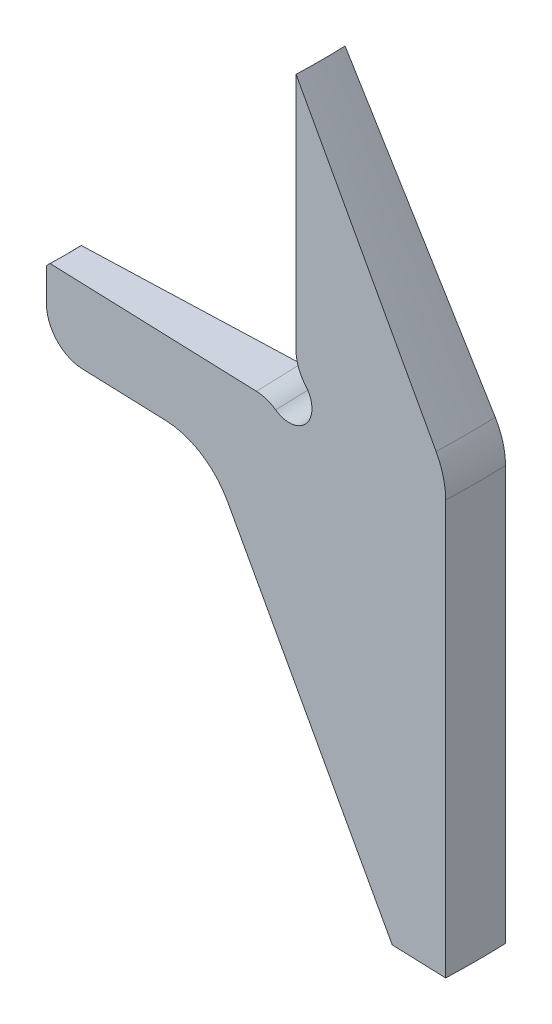
ISO-10303-21;
HEADER;
FILE_DESCRIPTION(('STEP AP214'),'2;1');
FILE_NAME('part.step','',(''),(''),'','','');
FILE_SCHEMA(('AUTOMOTIVE_DESIGN { 1 0 10303 214 1 1 1 1 }'));
ENDSEC;
DATA;
#1=APPLICATION_CONTEXT('core data for automotive mechanical design processes');
#2=APPLICATION_PROTOCOL_DEFINITION('international standard','automotive_design',2000,#1);
#3=PRODUCT_CONTEXT('',#1,'mechanical');
#4=PRODUCT('Part','Part','',(#3));
#5=PRODUCT_RELATED_PRODUCT_CATEGORY('part','',(#4));
#6=PRODUCT_DEFINITION_FORMATION('','',#4);
#7=PRODUCT_DEFINITION_CONTEXT('part definition',#1,'design');
#8=PRODUCT_DEFINITION('design','',#6,#7);
#9=PRODUCT_DEFINITION_SHAPE('','',#8);
#10=(LENGTH_UNIT() NAMED_UNIT(*) SI_UNIT(.MILLI.,.METRE.));
#11=(NAMED_UNIT(*) PLANE_ANGLE_UNIT() SI_UNIT($,.RADIAN.));
#12=(NAMED_UNIT(*) SI_UNIT($,.STERADIAN.) SOLID_ANGLE_UNIT());
#13=UNCERTAINTY_MEASURE_WITH_UNIT(LENGTH_MEASURE(1.E-05),#10,'distance_accuracy_value','');
#14=(GEOMETRIC_REPRESENTATION_CONTEXT(3) GLOBAL_UNCERTAINTY_ASSIGNED_CONTEXT((#13)) GLOBAL_UNIT_ASSIGNED_CONTEXT((#10,
#11,#12)) REPRESENTATION_CONTEXT('',''));
#15=CARTESIAN_POINT('',(0.,0.,0.));
#16=DIRECTION('',(0.,0.,1.));
#17=DIRECTION('',(1.,0.,0.));
#18=AXIS2_PLACEMENT_3D('',#15,#16,#17);
#19=CARTESIAN_POINT('',(-190.,-110.,0.));
#20=DIRECTION('',(0.,-1.,0.));
#21=DIRECTION('',(0.,0.,-1.));
#22=AXIS2_PLACEMENT_3D('',#19,#20,#21);
#23=CONICAL_SURFACE('',#22,216.961524227066,0.523598775598297);
#24=DIRECTION('',(-0.499695413509546,0.86602540378444,-0.0174497483512505));
#25=VECTOR('',#24,1.);
#26=CARTESIAN_POINT('',(-27.5092993180567,-15.8253175473054,5.67430030306673));
#27=LINE('',#26,#25);
#28=CARTESIAN_POINT('',(26.8293571286111,-110.,7.57184799933209));
#29=VERTEX_POINT('',#28);
#30=CARTESIAN_POINT('',(-19.3305279117981,-30.,5.95990929407039));
#31=VERTEX_POINT('',#30);
#32=EDGE_CURVE('E164',#29,#31,#27,.T.);
#33=ORIENTED_EDGE('',*,*,#32,.T.);
#34=CARTESIAN_POINT('',(-190.,-30.,0.));
#35=DIRECTION('',(0.,-1.,0.));
#36=DIRECTION('',(0.,0.,-1.));
#37=AXIS2_PLACEMENT_3D('',#34,#35,#36);
#38=CIRCLE('',#37,170.773502691896);
#39=CARTESIAN_POINT('',(-19.3305279117981,-30.,-5.95990929407039));
#40=VERTEX_POINT('',#39);
#41=EDGE_CURVE('E236',#31,#40,#38,.F.);
#42=ORIENTED_EDGE('',*,*,#41,.T.);
#43=DIRECTION('',(-0.499695413509546,0.86602540378444,0.0174497483512505));
#44=VECTOR('',#43,1.);
#45=CARTESIAN_POINT('',(-27.5092993180567,-15.8253175473054,-5.67430030306673));
#46=LINE('',#45,#44);
#47=CARTESIAN_POINT('',(26.8293571286111,-110.,-7.57184799933209));
#48=VERTEX_POINT('',#47);
#49=EDGE_CURVE('E167',#48,#40,#46,.T.);
#50=ORIENTED_EDGE('',*,*,#49,.F.);
#51=CARTESIAN_POINT('',(-190.,-110.,0.));
#52=DIRECTION('',(0.,-1.,0.));
#53=DIRECTION('',(0.,0.,-1.));
#54=AXIS2_PLACEMENT_3D('',#51,#52,#53);
#55=CIRCLE('',#54,216.961524227066);
#56=EDGE_CURVE('E162',#48,#29,#55,.T.);
#57=ORIENTED_EDGE('',*,*,#56,.T.);
#58=EDGE_LOOP('',(#33,#42,#50,#57));
#59=FACE_BOUND('',#58,.T.);
#60=ADVANCED_FACE('F43',(#59),#23,.F.);
#61=CARTESIAN_POINT('',(-0.115742866371919,-110.,-6.6309043734752));
#62=DIRECTION('',(0.,1.,0.));
#63=DIRECTION('',(0.,0.,1.));
#64=AXIS2_PLACEMENT_3D('',#61,#62,#63);
#65=PLANE('',#64);
#66=CARTESIAN_POINT('',(-190.,-110.,0.));
#67=DIRECTION('',(0.,-1.,0.));
#68=DIRECTION('',(0.,0.,-1.));
#69=AXIS2_PLACEMENT_3D('',#66,#67,#68);
#70=CIRCLE('',#69,231.961524227066);
#71=CARTESIAN_POINT('',(41.8202195338975,-110.,-8.09534044986961));
#72=VERTEX_POINT('',#71);
#73=CARTESIAN_POINT('',(41.8202195338975,-110.,8.09534044986961));
#74=VERTEX_POINT('',#73);
#75=EDGE_CURVE('E174',#72,#74,#70,.T.);
#76=ORIENTED_EDGE('',*,*,#75,.T.);
#77=DIRECTION('',(-0.999390827019096,0.,-0.034899496702501));
#78=VECTOR('',#77,1.);
#79=CARTESIAN_POINT('',(-0.115742866371911,-110.,6.63090437347519));
#80=LINE('',#79,#78);
#81=EDGE_CURVE('E179',#74,#29,#80,.T.);
#82=ORIENTED_EDGE('',*,*,#81,.T.);
#83=ORIENTED_EDGE('',*,*,#56,.F.);
#84=DIRECTION('',(-0.999390827019096,0.,0.0348994967025011));
#85=VECTOR('',#84,1.);
#86=CARTESIAN_POINT('',(-0.115742866371919,-110.,-6.6309043734752));
#87=LINE('',#86,#85);
#88=EDGE_CURVE('E210',#72,#48,#87,.T.);
#89=ORIENTED_EDGE('',*,*,#88,.F.);
#90=EDGE_LOOP('',(#76,#82,#83,#89));
#91=FACE_BOUND('',#90,.T.);
#92=ADVANCED_FACE('F186',(#91),#65,.F.);
#93=CARTESIAN_POINT('',(-190.,0.,0.));
#94=DIRECTION('',(0.,-1.,0.));
#95=DIRECTION('',(0.,0.,-1.));
#96=AXIS2_PLACEMENT_3D('',#93,#94,#95);
#97=CYLINDRICAL_SURFACE('',#96,231.961524227066);
#98=DIRECTION('',(0.,-1.,0.));
#99=VECTOR('',#98,1.);
#100=CARTESIAN_POINT('',(41.8202195338975,0.,-8.09534044986961));
#101=LINE('',#100,#99);
#102=CARTESIAN_POINT('',(41.8202195338975,1.9615242270665,-8.09534044986961));
#103=VERTEX_POINT('',#102);
#104=EDGE_CURVE('E212',#103,#72,#101,.T.);
#105=ORIENTED_EDGE('',*,*,#104,.F.);
#106=CARTESIAN_POINT('',(-190.,1.9615242270665,0.));
#107=DIRECTION('',(0.,1.,0.));
#108=DIRECTION('',(0.,0.,1.));
#109=AXIS2_PLACEMENT_3D('',#106,#107,#108);
#110=CIRCLE('',#109,231.961524227066);
#111=CARTESIAN_POINT('',(41.8202195338975,1.9615242270665,8.09534044986961));
#112=VERTEX_POINT('',#111);
#113=EDGE_CURVE('E239',#103,#112,#110,.F.);
#114=ORIENTED_EDGE('',*,*,#113,.T.);
#115=DIRECTION('',(0.,-1.,0.));
#116=VECTOR('',#115,1.);
#117=CARTESIAN_POINT('',(41.8202195338975,0.,8.09534044986961));
#118=LINE('',#117,#116);
#119=EDGE_CURVE('E188',#112,#74,#118,.T.);
#120=ORIENTED_EDGE('',*,*,#119,.T.);
#121=ORIENTED_EDGE('',*,*,#75,.F.);
#122=EDGE_LOOP('',(#105,#114,#120,#121));
#123=FACE_BOUND('',#122,.T.);
#124=ADVANCED_FACE('F382',(#123),#97,.T.);
#125=CARTESIAN_POINT('',(-190.,80.,0.));
#126=DIRECTION('',(0.,-1.,0.));
#127=DIRECTION('',(0.,0.,-1.));
#128=AXIS2_PLACEMENT_3D('',#125,#126,#127);
#129=CONICAL_SURFACE('',#128,190.,0.523598775598297);
#130=DIRECTION('',(0.499695413509546,-0.86602540378444,0.0174497483512505));
#131=VECTOR('',#130,1.);
#132=CARTESIAN_POINT('',(34.5041709139352,19.9999999999999,7.83985840242148));
#133=LINE('',#132,#131);
#134=CARTESIAN_POINT('',(-0.115742866371803,80.,6.6309043734752));
#135=VERTEX_POINT('',#134);
#136=CARTESIAN_POINT('',(39.1423598836692,11.9615242270665,8.00182753029273));
#137=VERTEX_POINT('',#136);
#138=EDGE_CURVE('E190',#135,#137,#133,.T.);
#139=ORIENTED_EDGE('',*,*,#138,.T.);
#140=CARTESIAN_POINT('',(-190.,11.9615242270665,0.));
#141=DIRECTION('',(0.,1.,0.));
#142=DIRECTION('',(0.,0.,1.));
#143=AXIS2_PLACEMENT_3D('',#140,#141,#142);
#144=CIRCLE('',#143,229.282032302755);
#145=CARTESIAN_POINT('',(39.1423598836692,11.9615242270665,-8.00182753029273));
#146=VERTEX_POINT('',#145);
#147=EDGE_CURVE('E244',#137,#146,#144,.T.);
#148=ORIENTED_EDGE('',*,*,#147,.T.);
#149=DIRECTION('',(0.499695413509546,-0.86602540378444,-0.0174497483512505));
#150=VECTOR('',#149,1.);
#151=CARTESIAN_POINT('',(34.5041709139352,19.9999999999999,-7.83985840242149));
#152=LINE('',#151,#150);
#153=CARTESIAN_POINT('',(-0.11574286637181,80.,-6.6309043734752));
#154=VERTEX_POINT('',#153);
#155=EDGE_CURVE('E214',#154,#146,#152,.T.);
#156=ORIENTED_EDGE('',*,*,#155,.F.);
#157=CARTESIAN_POINT('',(-190.,80.,0.));
#158=DIRECTION('',(0.,-1.,0.));
#159=DIRECTION('',(0.,0.,-1.));
#160=AXIS2_PLACEMENT_3D('',#157,#158,#159);
#161=CIRCLE('',#160,190.);
#162=EDGE_CURVE('E229',#154,#135,#161,.T.);
#163=ORIENTED_EDGE('',*,*,#162,.T.);
#164=EDGE_LOOP('',(#139,#148,#156,#163));
#165=FACE_BOUND('',#164,.T.);
#166=ADVANCED_FACE('F319',(#165),#129,.T.);
#167=CARTESIAN_POINT('',(-190.,0.,0.));
#168=DIRECTION('',(0.,-1.,0.));
#169=DIRECTION('',(0.,0.,-1.));
#170=AXIS2_PLACEMENT_3D('',#167,#168,#169);
#171=CYLINDRICAL_SURFACE('',#170,190.);
#172=DIRECTION('',(0.,1.,0.));
#173=VECTOR('',#172,1.);
#174=CARTESIAN_POINT('',(-0.115742866371817,0.,-6.6309043734752));
#175=LINE('',#174,#173);
#176=CARTESIAN_POINT('',(-0.115742866371817,14.7588839550941,-6.6309043734752));
#177=VERTEX_POINT('',#176);
#178=EDGE_CURVE('E217',#177,#154,#175,.T.);
#179=ORIENTED_EDGE('',*,*,#178,.F.);
#180=CARTESIAN_POINT('',(0.667134274224194,8.95759896307096,-33.086227751893));
#181=CARTESIAN_POINT('',(-2.74176370552451,11.9327504312319,-32.1656281770773));
#182=CARTESIAN_POINT('',(-2.65446045368407,16.5202245868414,-31.6488358727422));
#183=CARTESIAN_POINT('',(0.768508186004366,8.9047338826774,-31.9341825681366));
#184=CARTESIAN_POINT('',(-2.55182244152968,11.8754683558055,-31.0597075428148));
#185=CARTESIAN_POINT('',(-2.47009392802789,16.3871162300827,-30.5574681168625));
#186=CARTESIAN_POINT('',(0.865964263219567,8.85334792421901,-30.7802043294137));
#187=CARTESIAN_POINT('',(-2.3708638516568,11.8173309382447,-29.9470364161878));
#188=CARTESIAN_POINT('',(-2.29518917855884,16.2577321367232,-29.4640635193674));
#189=CARTESIAN_POINT('',(1.0530127110721,8.7547300066573,-28.4684270306068));
#190=CARTESIAN_POINT('',(-2.02861120265951,11.7025410499396,-27.7167586211394));
#191=CARTESIAN_POINT('',(-1.96436797033006,16.0094232554202,-27.2732223347117));
#192=CARTESIAN_POINT('',(1.14260439152294,8.70749841214394,-27.3106276444088));
#193=CARTESIAN_POINT('',(-1.86708705897681,11.6458366593084,-26.5983101221771));
#194=CARTESIAN_POINT('',(-1.8084531776815,15.8904993854735,-26.1757854024577));
#195=CARTESIAN_POINT('',(1.31394857964027,8.61835806461816,-24.990502677886));
#196=CARTESIAN_POINT('',(-1.56380075092368,11.5365835990525,-24.3560952427382));
#197=CARTESIAN_POINT('',(-1.5155887175918,15.6660539648379,-23.976209439212));
#198=CARTESIAN_POINT('',(1.39569458613769,8.5764537167538,-23.8281741603763));
#199=CARTESIAN_POINT('',(-1.42185385510603,11.483978502793,-23.2314802361726));
#200=CARTESIAN_POINT('',(-1.37865473721144,15.5605435058189,-22.874067285765));
#201=CARTESIAN_POINT('',(1.55121302986134,8.49918585962328,-21.5002545251547));
#202=CARTESIAN_POINT('',(-1.15804335513335,11.3855336526382,-20.9784182802711));
#203=CARTESIAN_POINT('',(-1.12400958891225,15.3659916881925,-20.6662767542916));
#204=CARTESIAN_POINT('',(1.62498570089126,8.46382215854281,-20.3346635041386));
#205=CARTESIAN_POINT('',(-1.03600965465167,11.3396329605667,-19.8491285600782));
#206=CARTESIAN_POINT('',(-1.00629785728391,15.2769498466181,-19.5606284800551));
#207=CARTESIAN_POINT('',(1.76426680994774,8.40082060062587,-18.0045907092262));
#208=CARTESIAN_POINT('',(-0.812562825333102,11.257031946277,-17.5911977399515));
#209=CARTESIAN_POINT('',(-0.790572085281535,15.1183189735415,-17.3499720215171));
#210=CARTESIAN_POINT('',(1.82980261238954,8.37315677012357,-16.8401187427663));
#211=CARTESIAN_POINT('',(-0.710944068877488,11.2202460392795,-16.4617389642819));
#212=CARTESIAN_POINT('',(-0.692492144197733,15.0486645432593,-16.2449745477766));
#213=CARTESIAN_POINT('',(1.95284672119456,8.32630034887294,-14.5088630105438));
#214=CARTESIAN_POINT('',(-0.527943504460698,11.1575583667022,-14.2004053186003));
#215=CARTESIAN_POINT('',(-0.51563615265279,14.9306853171667,-14.0323755942664));
#216=CARTESIAN_POINT('',(2.0103548734032,8.30710792078524,-13.3420792008232));
#217=CARTESIAN_POINT('',(-0.446454855424195,11.1316125114773,-13.0676887957924));
#218=CARTESIAN_POINT('',(-0.436860472868506,14.8823609309176,-12.9247740649064));
#219=CARTESIAN_POINT('',(2.117264391476,8.27786808171482,-11.007446958684));
#220=CARTESIAN_POINT('',(-0.303854862242663,11.0919796335105,-10.8012816006396));
#221=CARTESIAN_POINT('',(-0.298739801295778,14.8087382882925,-10.7081500205029));
#222=CARTESIAN_POINT('',(2.16666926395919,8.26781670642283,-9.83959920785168));
#223=CARTESIAN_POINT('',(-0.242657818869594,11.0782582597378,-9.6667476316496));
#224=CARTESIAN_POINT('',(-0.239386393575631,14.7834300502293,-9.59912833052618));
#225=CARTESIAN_POINT('',(2.25735519613433,8.25721037148466,-7.50319344789874));
#226=CARTESIAN_POINT('',(-0.140658917715771,11.0637888034485,-7.39727685749175));
#227=CARTESIAN_POINT('',(-0.140133141601371,14.7567244855712,-7.38000037709744));
#228=CARTESIAN_POINT('',(2.29863674432749,8.25665484062728,-6.33463548572886));
#229=CARTESIAN_POINT('',(-0.0998092608036908,11.0630291330192,-6.2614931294416));
#230=CARTESIAN_POINT('',(-0.100232127352002,14.7553257207305,-6.26989418289986));
#231=CARTESIAN_POINT('',(2.35012083027892,8.26246376172975,-4.71770129828353));
#232=CARTESIAN_POINT('',(-0.0573982866506212,11.0709539252145,-4.69042229417288));
#233=CARTESIAN_POINT('',(-0.0584953479908712,14.7699519341809,-4.7335562145751));
#234=CARTESIAN_POINT('',(2.36379952852938,8.26477505003423,-4.26925416586011));
#235=CARTESIAN_POINT('',(-0.0471346803368433,11.0741083817843,-4.25460208882068));
#236=CARTESIAN_POINT('',(-0.0483543007045109,14.7757714995944,-4.30743178481242));
#237=CARTESIAN_POINT('',(2.38995537633869,8.27078201629363,-3.37242251394286));
#238=CARTESIAN_POINT('',(-0.0296071203080356,11.0822949235631,-3.38303367218752));
#239=CARTESIAN_POINT('',(-0.0309410438588276,14.7908963684776,-3.45518208660384));
#240=CARTESIAN_POINT('',(2.40243253636975,8.27447768218139,-2.92403799393735));
#241=CARTESIAN_POINT('',(-0.0223428861444891,11.0873278872371,-2.94723752617663));
#242=CARTESIAN_POINT('',(-0.0236688092941635,14.8002016415635,-3.02905681819764));
#243=CARTESIAN_POINT('',(2.4380643492947,8.28761535694021,-1.57890415935268));
#244=CARTESIAN_POINT('',(-0.00504296787389616,11.1051920275726,-1.63967725650893));
#245=CARTESIAN_POINT('',(-0.00615274517554352,14.8332808363654,-1.75060927397026));
#246=CARTESIAN_POINT('',(2.45941501142037,8.29910754453079,-0.682310370303468));
#247=CARTESIAN_POINT('',(0.000487439010154739,11.1207896421213,-0.768039096448333));
#248=CARTESIAN_POINT('',(-0.000213059670241137,14.8622168787704,-0.898344290288824));
#249=CARTESIAN_POINT('',(2.50770020926859,8.33507459532026,1.60193791038056));
#250=CARTESIAN_POINT('',(-0.000677853179735361,11.1693352615863,1.45282438471778));
#251=CARTESIAN_POINT('',(0.000315590945780388,14.9527778882737,1.27327496392541));
#252=CARTESIAN_POINT('',(2.53126937943034,8.36321310429918,2.98906644606564));
#253=CARTESIAN_POINT('',(-0.0157921741423428,11.2071349557853,2.80174574030716));
#254=CARTESIAN_POINT('',(-0.0131130138513921,15.0236275056256,2.59229791091934));
#255=CARTESIAN_POINT('',(2.56688395259442,8.43072140174762,5.76041616248337));
#256=CARTESIAN_POINT('',(-0.074496742487387,11.2964258604122,5.49492825049505));
#257=CARTESIAN_POINT('',(-0.0673685402757303,15.1936058445098,5.22815629013314));
#258=CARTESIAN_POINT('',(2.57892851431392,8.47009200987485,7.14463712360808));
#259=CARTESIAN_POINT('',(-0.118201026339044,11.348004386642,6.84060859323841));
#260=CARTESIAN_POINT('',(-0.108197461723636,15.2927366298485,6.5449915556514));
#261=CARTESIAN_POINT('',(2.59783811426675,8.60253900922191,11.2933062489235));
#262=CARTESIAN_POINT('',(-0.292127209835841,11.518241998313,10.8783053655054));
#263=CARTESIAN_POINT('',(-0.271653014554545,15.626223353429,10.4925625392756));
#264=CARTESIAN_POINT('',(2.58744901132575,8.70992483589788,14.052334241045));
#265=CARTESIAN_POINT('',(-0.465571300246929,11.6523216909378,13.5623515718648));
#266=CARTESIAN_POINT('',(-0.435248534974838,15.8966088500329,13.1190073575536));
#267=CARTESIAN_POINT('',(2.53762222162231,8.88783439279323,18.178996887546));
#268=CARTESIAN_POINT('',(-0.806882194384979,11.8567067555848,17.5506840311638));
#269=CARTESIAN_POINT('',(-0.761893577844636,16.3445652062546,17.0490905776314));
#270=CARTESIAN_POINT('',(2.51527366759193,8.95000065562477,19.5536943794646));
#271=CARTESIAN_POINT('',(-0.935272419916723,11.9258760937013,18.8831748369782));
#272=CARTESIAN_POINT('',(-0.884451235087477,16.5010928993007,18.3585915953837));
#273=CARTESIAN_POINT('',(2.45916710720859,9.0779276803314,22.2985372625312));
#274=CARTESIAN_POINT('',(-1.21931327310273,12.0608612155418,21.5398910861035));
#275=CARTESIAN_POINT('',(-1.15660890436113,16.8231988322194,20.9738349694822));
#276=CARTESIAN_POINT('',(2.42540895247495,9.14368848894387,23.6686825942447));
#277=CARTESIAN_POINT('',(-1.37532741260926,12.1267288346485,22.8655648164975));
#278=CARTESIAN_POINT('',(-1.30620926806779,16.9887771897715,22.2795772767241));
#279=CARTESIAN_POINT('',(2.34655232286599,9.27679761280046,26.4026507350959));
#280=CARTESIAN_POINT('',(-1.71404614876678,12.2503140847362,25.5062367397936));
#281=CARTESIAN_POINT('',(-1.63219806622322,17.3239310693093,24.8856147427336));
#282=CARTESIAN_POINT('',(2.30146751762161,9.34414392641018,27.7664791616062));
#283=CARTESIAN_POINT('',(-1.89715018041173,12.3080444767054,26.8227227732966));
#284=CARTESIAN_POINT('',(-1.80855410953062,17.4935015514033,26.1859145603682));
#285=CARTESIAN_POINT('',(2.19994319968825,9.47867393047736,30.4894031023221));
#286=CARTESIAN_POINT('',(-2.28965466041325,12.4107488770535,29.4456933830482));
#287=CARTESIAN_POINT('',(-2.1881686046213,17.8322330482642,28.7825806923877));
#288=CARTESIAN_POINT('',(2.14350409682512,9.54585762671583,31.8484987855522));
#289=CARTESIAN_POINT('',(-2.49955477510499,12.4556583497594,30.7536700678683));
#290=CARTESIAN_POINT('',(-2.39142608532444,18.0013940775871,30.0789471470311));
#291=CARTESIAN_POINT('',(2.0813890476718,9.61204948654276,33.2052450635102));
#292=CARTESIAN_POINT('',(-2.72123394142446,12.4914385343895,32.0489148945612));
#293=CARTESIAN_POINT('',(-2.60813226397439,18.1680577731969,31.3733630075558));
#294=(BOUNDED_SURFACE() B_SPLINE_SURFACE(3,2,((#180,#181,#182),(#183,#184,#185),(#186,#187,
#188),(#189,#190,#191),(#192,#193,#194),(#195,#196,#197),(#198,#199,#200),(#201,#202,#203),
(#204,#205,#206),(#207,#208,#209),(#210,#211,#212),(#213,#214,#215),(#216,#217,#218),(#219,#220,
#221),(#222,#223,#224),(#225,#226,#227),(#228,#229,#230),(#231,#232,#233),(#234,#235,#236),
(#237,#238,#239),(#240,#241,#242),(#243,#244,#245),(#246,#247,#248),(#249,#250,#251),(#252,#253,
#254),(#255,#256,#257),(#258,#259,#260),(#261,#262,#263),(#264,#265,#266),(#267,#268,#269),
(#270,#271,#272),(#273,#274,#275),(#276,#277,#278),(#279,#280,#281),(#282,#283,#284),(#285,#286,
#287),(#288,#289,#290),(#291,#292,#293)),.UNSPECIFIED.,.F.,.F.,
.F.) B_SPLINE_SURFACE_WITH_KNOTS((4,2,2,2,2,2,2,2,2,2,2,2,2,2,2,2,2,2,4),(3,3),(0.,
3.51798708399858,7.03628260165581,10.5574687632261,14.0785516443337,17.5876089325519,
21.0967335957609,24.6043356883423,28.1117267845609,29.4578597379756,30.8039809578751,
33.4966309497193,37.6669125575601,41.8374985678237,50.1829515541114,54.3625431233224,
58.5421890497831,62.7168147773553,66.8912898516),(0.,1.),
.UNSPECIFIED.) GEOMETRIC_REPRESENTATION_ITEM() RATIONAL_B_SPLINE_SURFACE(((1.,0.907892624053053,
1.),(1.,0.91056277963586,1.),(1.,0.91305326888257,1.),(1.,0.917677669728983,1.),(1.,
0.91981155004719,1.),(1.,0.923726628411904,1.),(1.,0.925507535252983,1.),(1.,0.928715758702234,
1.),(1.,0.930143085680084,1.),(1.,0.932640611466148,1.),(1.,0.933712013329267,1.),(1.,
0.935504529176689,1.),(1.,0.936225636434959,1.),(1.,0.937317204954832,1.),(1.,0.937687818222124,
1.),(1.,0.938078805641152,1.),(1.,0.938099200859837,1.),(1.,0.937885139438573,1.),(1.,
0.937799978645177,1.),(1.,0.937578083745593,1.),(1.,0.937441350088948,1.),(1.,0.936953744759836,
1.),(1.,0.936525486703279,1.),(1.,0.935171052417401,1.),(1.,0.934100603053463,1.),(1.,
0.931464790521467,1.),(1.,0.929899391233743,1.),(1.,0.924457892139941,1.),(1.,0.91983733455556,
1.),(1.,0.911396793741079,1.),(1.,0.908328523489701,1.),(1.,0.90168155671136,1.),(1.,
0.898102853546621,1.),(1.,0.890431346264138,1.),(1.,0.886339164799106,1.),(1.,0.877625513013661,
1.),(1.,0.873004061799482,1.),(1.,0.868111917035176,1.))) REPRESENTATION_ITEM('') SURFACE());
#295=CARTESIAN_POINT('',(-2.65446045368407,16.5202245868414,-31.6488358727422));
#296=CARTESIAN_POINT('',(-2.47009392802789,16.3871162300827,-30.5574681168625));
#297=CARTESIAN_POINT('',(-2.29518917855884,16.2577321367232,-29.4640635193674));
#298=CARTESIAN_POINT('',(-1.96436797033006,16.0094232554202,-27.2732223347117));
#299=CARTESIAN_POINT('',(-1.8084531776815,15.8904993854735,-26.1757854024577));
#300=CARTESIAN_POINT('',(-1.5155887175918,15.6660539648379,-23.976209439212));
#301=CARTESIAN_POINT('',(-1.37865473721144,15.5605435058189,-22.874067285765));
#302=CARTESIAN_POINT('',(-1.12400958891225,15.3659916881925,-20.6662767542916));
#303=CARTESIAN_POINT('',(-1.00629785728391,15.2769498466181,-19.5606284800551));
#304=CARTESIAN_POINT('',(-0.790572085281535,15.1183189735415,-17.3499720215171));
#305=CARTESIAN_POINT('',(-0.692492144197733,15.0486645432593,-16.2449745477766));
#306=CARTESIAN_POINT('',(-0.51563615265279,14.9306853171667,-14.0323755942664));
#307=CARTESIAN_POINT('',(-0.436860472868506,14.8823609309176,-12.9247740649064));
#308=CARTESIAN_POINT('',(-0.298739801295778,14.8087382882925,-10.7081500205029));
#309=CARTESIAN_POINT('',(-0.239386393575631,14.7834300502293,-9.59912833052618));
#310=CARTESIAN_POINT('',(-0.14013314160137,14.7567244855712,-7.38000037709744));
#311=CARTESIAN_POINT('',(-0.100232127352002,14.7553257207305,-6.26989418289986));
#312=CARTESIAN_POINT('',(-0.0584953479908712,14.7699519341809,-4.7335562145751));
#313=CARTESIAN_POINT('',(-0.0483543007045109,14.7757714995944,-4.30743178481242));
#314=CARTESIAN_POINT('',(-0.0309410438588276,14.7908963684776,-3.45518208660384));
#315=CARTESIAN_POINT('',(-0.0236688092941635,14.8002016415635,-3.02905681819764));
#316=CARTESIAN_POINT('',(-0.00615274517554354,14.8332808363654,-1.75060927397026));
#317=CARTESIAN_POINT('',(-0.000213059670241142,14.8622168787704,-0.898344290288825));
#318=CARTESIAN_POINT('',(0.000315590945780396,14.9527778882737,1.27327496392541));
#319=CARTESIAN_POINT('',(-0.0131130138513921,15.0236275056256,2.59229791091935));
#320=CARTESIAN_POINT('',(-0.0673685402757303,15.1936058445098,5.22815629013314));
#321=CARTESIAN_POINT('',(-0.108197461723636,15.2927366298485,6.5449915556514));
#322=CARTESIAN_POINT('',(-0.271653014554545,15.626223353429,10.4925625392756));
#323=CARTESIAN_POINT('',(-0.435248534974838,15.8966088500329,13.1190073575536));
#324=CARTESIAN_POINT('',(-0.761893577844636,16.3445652062546,17.0490905776314));
#325=CARTESIAN_POINT('',(-0.884451235087477,16.5010928993007,18.3585915953837));
#326=CARTESIAN_POINT('',(-1.15660890436113,16.8231988322194,20.9738349694822));
#327=CARTESIAN_POINT('',(-1.30620926806779,16.9887771897715,22.2795772767241));
#328=CARTESIAN_POINT('',(-1.63219806622322,17.3239310693093,24.8856147427336));
#329=CARTESIAN_POINT('',(-1.80855410953062,17.4935015514033,26.1859145603682));
#330=CARTESIAN_POINT('',(-2.1881686046213,17.8322330482642,28.7825806923877));
#331=CARTESIAN_POINT('',(-2.39142608532444,18.0013940775871,30.0789471470311));
#332=CARTESIAN_POINT('',(-2.60813226397439,18.1680577731969,31.3733630075558));
#333=B_SPLINE_CURVE_WITH_KNOTS('',3,(#295,#296,#297,#298,#299,#300,#301,#302,#303,#304,#305,
#306,#307,#308,#309,#310,#311,#312,#313,#314,#315,#316,#317,#318,#319,#320,#321,#322,#323,#324,
#325,#326,#327,#328,#329,#330,#331,#332),.UNSPECIFIED.,.F.,.F.,(4,2,2,2,2,2,2,2,2,2,2,2,2,2,2,2,
2,2,4),(0.,3.51798708399858,7.03628260165581,10.5574687632261,14.0785516443337,17.5876089325519,
21.0967335957609,24.6043356883423,28.1117267845609,29.4578597379756,30.8039809578751,
33.4966309497193,37.6669125575601,41.8374985678237,50.1829515541114,54.3625431233224,
58.5421890497831,62.7168147773553,66.8912898516),.UNSPECIFIED.);
#334=CARTESIAN_POINT('',(-0.11574286637181,15.3035860230109,6.6309043734752));
#335=VERTEX_POINT('',#334);
#336=EDGE_CURVE('E11',#177,#335,#333,.T.);
#337=ORIENTED_EDGE('',*,*,#336,.T.);
#338=DIRECTION('',(0.,1.,0.));
#339=VECTOR('',#338,1.);
#340=CARTESIAN_POINT('',(-0.11574286637181,0.,6.6309043734752));
#341=LINE('',#340,#339);
#342=EDGE_CURVE('E196',#335,#135,#341,.T.);
#343=ORIENTED_EDGE('',*,*,#342,.T.);
#344=ORIENTED_EDGE('',*,*,#162,.F.);
#345=EDGE_LOOP('',(#179,#337,#343,#344));
#346=FACE_BOUND('',#345,.T.);
#347=ADVANCED_FACE('F313',(#346),#171,.F.);
#348=CARTESIAN_POINT('',(-0.115742866371817,0.,-6.6309043734752));
#349=DIRECTION('',(0.,-1.,0.));
#350=DIRECTION('',(0.,0.,-1.));
#351=AXIS2_PLACEMENT_3D('',#348,#349,#350);
#352=PLANE('',#351);
#353=DIRECTION('',(0.999390827019096,0.,0.034899496702501));
#354=VECTOR('',#353,1.);
#355=CARTESIAN_POINT('',(-0.11574286637181,0.,6.6309043734752));
#356=LINE('',#355,#354);
#357=CARTESIAN_POINT('',(-69.0737099306894,0.,4.22283910100263));
#358=VERTEX_POINT('',#357);
#359=CARTESIAN_POINT('',(-11.2141846253441,0.,6.24333824709254));
#360=VERTEX_POINT('',#359);
#361=EDGE_CURVE('E198',#358,#360,#356,.T.);
#362=ORIENTED_EDGE('',*,*,#361,.T.);
#363=DIRECTION('',(-0.0348994967025011,0.,-0.999390827019096));
#364=VECTOR('',#363,1.);
#365=CARTESIAN_POINT('',(-11.6496978858531,0.,-6.22812978891171));
#366=LINE('',#365,#364);
#367=CARTESIAN_POINT('',(-11.6496978858531,0.,-6.22812978891171));
#368=VERTEX_POINT('',#367);
#369=EDGE_CURVE('E276',#360,#368,#366,.T.);
#370=ORIENTED_EDGE('',*,*,#369,.T.);
#371=DIRECTION('',(0.999390827019096,0.,-0.0348994967025011));
#372=VECTOR('',#371,1.);
#373=CARTESIAN_POINT('',(-0.115742866371817,0.,-6.6309043734752));
#374=LINE('',#373,#372);
#375=CARTESIAN_POINT('',(-69.0737099306894,0.,-4.22283910100263));
#376=VERTEX_POINT('',#375);
#377=EDGE_CURVE('E219',#376,#368,#374,.T.);
#378=ORIENTED_EDGE('',*,*,#377,.F.);
#379=CARTESIAN_POINT('',(-190.,0.,0.));
#380=DIRECTION('',(0.,-1.,0.));
#381=DIRECTION('',(0.,0.,-1.));
#382=AXIS2_PLACEMENT_3D('',#379,#380,#381);
#383=CIRCLE('',#382,121.);
#384=EDGE_CURVE('E265',#376,#358,#383,.T.);
#385=ORIENTED_EDGE('',*,*,#384,.T.);
#386=EDGE_LOOP('',(#362,#370,#378,#385));
#387=FACE_BOUND('',#386,.T.);
#388=ADVANCED_FACE('F318',(#387),#352,.F.);
#389=CARTESIAN_POINT('',(-190.,0.,0.));
#390=DIRECTION('',(0.,-1.,0.));
#391=DIRECTION('',(0.,0.,-1.));
#392=AXIS2_PLACEMENT_3D('',#389,#390,#391);
#393=CYLINDRICAL_SURFACE('',#392,120.);
#394=DIRECTION('',(0.,1.,0.));
#395=VECTOR('',#394,1.);
#396=CARTESIAN_POINT('',(-70.0731007577085,0.,4.18793960430013));
#397=LINE('',#396,#395);
#398=CARTESIAN_POINT('',(-70.0731007577085,-10.,4.18793960430013));
#399=VERTEX_POINT('',#398);
#400=CARTESIAN_POINT('',(-70.0731007577085,-0.999999999999987,4.18793960430013));
#401=VERTEX_POINT('',#400);
#402=EDGE_CURVE('E201',#399,#401,#397,.T.);
#403=ORIENTED_EDGE('',*,*,#402,.T.);
#404=CARTESIAN_POINT('',(-190.,-0.999999999999987,0.));
#405=DIRECTION('',(0.,-1.,0.));
#406=DIRECTION('',(0.,0.,-1.));
#407=AXIS2_PLACEMENT_3D('',#404,#405,#406);
#408=CIRCLE('',#407,120.);
#409=CARTESIAN_POINT('',(-70.0731007577085,-0.999999999999987,-4.18793960430013));
#410=VERTEX_POINT('',#409);
#411=EDGE_CURVE('E270',#401,#410,#408,.F.);
#412=ORIENTED_EDGE('',*,*,#411,.T.);
#413=DIRECTION('',(0.,1.,0.));
#414=VECTOR('',#413,1.);
#415=CARTESIAN_POINT('',(-70.0731007577085,0.,-4.18793960430013));
#416=LINE('',#415,#414);
#417=CARTESIAN_POINT('',(-70.0731007577085,-10.,-4.18793960430013));
#418=VERTEX_POINT('',#417);
#419=EDGE_CURVE('E222',#418,#410,#416,.T.);
#420=ORIENTED_EDGE('',*,*,#419,.F.);
#421=CARTESIAN_POINT('',(-190.,-10.,0.));
#422=DIRECTION('',(0.,1.,0.));
#423=DIRECTION('',(0.,0.,1.));
#424=AXIS2_PLACEMENT_3D('',#421,#422,#423);
#425=CIRCLE('',#424,120.);
#426=EDGE_CURVE('E253',#418,#399,#425,.F.);
#427=ORIENTED_EDGE('',*,*,#426,.T.);
#428=EDGE_LOOP('',(#403,#412,#420,#427));
#429=FACE_BOUND('',#428,.T.);
#430=ADVANCED_FACE('F345',(#429),#393,.F.);
#431=CARTESIAN_POINT('',(-0.115742866371816,-20.,-6.6309043734752));
#432=DIRECTION('',(0.,1.,0.));
#433=DIRECTION('',(0.,0.,1.));
#434=AXIS2_PLACEMENT_3D('',#431,#432,#433);
#435=PLANE('',#434);
#436=DIRECTION('',(-0.999390827019096,0.,-0.034899496702501));
#437=VECTOR('',#436,1.);
#438=CARTESIAN_POINT('',(-0.115742866371808,-20.,6.6309043734752));
#439=LINE('',#438,#437);
#440=CARTESIAN_POINT('',(-36.6404848019516,-20.,5.35543227959724));
#441=VERTEX_POINT('',#440);
#442=CARTESIAN_POINT('',(-60.0791924875176,-20.,4.53693457132514));
#443=VERTEX_POINT('',#442);
#444=EDGE_CURVE('E204',#441,#443,#439,.T.);
#445=ORIENTED_EDGE('',*,*,#444,.T.);
#446=CARTESIAN_POINT('',(-190.,-20.,0.));
#447=DIRECTION('',(0.,1.,0.));
#448=DIRECTION('',(0.,0.,1.));
#449=AXIS2_PLACEMENT_3D('',#446,#447,#448);
#450=CIRCLE('',#449,130.);
#451=CARTESIAN_POINT('',(-60.0791924875175,-20.,-4.53693457132514));
#452=VERTEX_POINT('',#451);
#453=EDGE_CURVE('E259',#443,#452,#450,.T.);
#454=ORIENTED_EDGE('',*,*,#453,.T.);
#455=DIRECTION('',(-0.999390827019096,0.,0.0348994967025011));
#456=VECTOR('',#455,1.);
#457=CARTESIAN_POINT('',(-0.115742866371816,-20.,-6.6309043734752));
#458=LINE('',#457,#456);
#459=CARTESIAN_POINT('',(-36.6404848019516,-20.,-5.35543227959724));
#460=VERTEX_POINT('',#459);
#461=EDGE_CURVE('E225',#460,#452,#458,.T.);
#462=ORIENTED_EDGE('',*,*,#461,.F.);
#463=CARTESIAN_POINT('',(-190.,-20.,0.));
#464=DIRECTION('',(0.,1.,0.));
#465=DIRECTION('',(0.,0.,1.));
#466=AXIS2_PLACEMENT_3D('',#463,#464,#465);
#467=CIRCLE('',#466,153.452994616207);
#468=EDGE_CURVE('E173',#460,#441,#467,.F.);
#469=ORIENTED_EDGE('',*,*,#468,.T.);
#470=EDGE_LOOP('',(#445,#454,#462,#469));
#471=FACE_BOUND('',#470,.T.);
#472=ADVANCED_FACE('F340',(#471),#435,.F.);
#473=CARTESIAN_POINT('',(-0.115742866371817,0.,-6.6309043734752));
#474=DIRECTION('',(0.0348994967025011,0.,0.999390827019096));
#475=DIRECTION('',(0.999390827019096,0.,-0.0348994967025011));
#476=AXIS2_PLACEMENT_3D('',#473,#474,#475);
#477=PLANE('',#476);
#478=ORIENTED_EDGE('',*,*,#377,.T.);
#479=CARTESIAN_POINT('',(-11.6496978858531,-10.,-6.22812978891171));
#480=DIRECTION('',(0.0348994967025011,0.,0.999390827019096));
#481=DIRECTION('',(0.999390827019096,0.,-0.0348994967025011));
#482=AXIS2_PLACEMENT_3D('',#479,#480,#481);
#483=CIRCLE('',#482,10.);
#484=CARTESIAN_POINT('',(-6.26581804561778,-1.57512668365161,-6.41613901578383));
#485=VERTEX_POINT('',#484);
#486=EDGE_CURVE('E281',#368,#485,#483,.F.);
#487=ORIENTED_EDGE('',*,*,#486,.T.);
#488=CARTESIAN_POINT('',(-2.71886367304738,3.97526488052335,-6.54000139182611));
#489=DIRECTION('',(-0.0348994967025011,0.,-0.999390827019096));
#490=DIRECTION('',(-0.999390827019096,0.,0.0348994967025011));
#491=AXIS2_PLACEMENT_3D('',#488,#489,#490);
#492=CIRCLE('',#491,6.58810091945773);
#493=CARTESIAN_POINT('',(2.28415018891875,8.25806802267977,-6.71471048566385));
#494=VERTEX_POINT('',#493);
#495=EDGE_CURVE('E183',#494,#485,#492,.T.);
#496=ORIENTED_EDGE('',*,*,#495,.F.);
#497=CARTESIAN_POINT('',(9.87816540381916,14.7588839550945,-6.97989934050024));
#498=DIRECTION('',(0.0348994967025011,0.,0.999390827019096));
#499=DIRECTION('',(0.999390827019096,0.,-0.0348994967025011));
#500=AXIS2_PLACEMENT_3D('',#497,#498,#499);
#501=CIRCLE('',#500,10.);
#502=EDGE_CURVE('E279',#494,#177,#501,.F.);
#503=ORIENTED_EDGE('',*,*,#502,.T.);
#504=ORIENTED_EDGE('',*,*,#178,.T.);
#505=ORIENTED_EDGE('',*,*,#155,.T.);
#506=CARTESIAN_POINT('',(21.8324029935157,1.9615242270665,-7.39735051581959));
#507=DIRECTION('',(0.0348994967025011,0.,0.999390827019096));
#508=DIRECTION('',(0.999390827019096,0.,-0.0348994967025011));
#509=AXIS2_PLACEMENT_3D('',#506,#507,#508);
#510=CIRCLE('',#509,20.);
#511=EDGE_CURVE('E246',#146,#103,#510,.F.);
#512=ORIENTED_EDGE('',*,*,#511,.T.);
#513=ORIENTED_EDGE('',*,*,#104,.T.);
#514=ORIENTED_EDGE('',*,*,#88,.T.);
#515=ORIENTED_EDGE('',*,*,#49,.T.);
#516=CARTESIAN_POINT('',(-36.6404848019516,-40.,-5.35543227959724));
#517=DIRECTION('',(0.0348994967025011,0.,0.999390827019096));
#518=DIRECTION('',(0.999390827019096,0.,-0.0348994967025011));
#519=AXIS2_PLACEMENT_3D('',#516,#517,#518);
#520=CIRCLE('',#519,20.);
#521=EDGE_CURVE('E250',#40,#460,#520,.T.);
#522=ORIENTED_EDGE('',*,*,#521,.T.);
#523=ORIENTED_EDGE('',*,*,#461,.T.);
#524=CARTESIAN_POINT('',(-60.0791924875175,-10.,-4.53693457132514));
#525=DIRECTION('',(0.0348994967025011,0.,0.999390827019096));
#526=DIRECTION('',(0.999390827019096,0.,-0.0348994967025011));
#527=AXIS2_PLACEMENT_3D('',#524,#525,#526);
#528=CIRCLE('',#527,10.);
#529=EDGE_CURVE('E262',#452,#418,#528,.F.);
#530=ORIENTED_EDGE('',*,*,#529,.T.);
#531=ORIENTED_EDGE('',*,*,#419,.T.);
#532=DIRECTION('',(0.706676030840844,0.707106781186538,-0.0246776707783364));
#533=VECTOR('',#532,1.);
#534=CARTESIAN_POINT('',(-190.,-120.999999999997,0.));
#535=LINE('',#534,#533);
#536=EDGE_CURVE('E272',#410,#376,#535,.T.);
#537=ORIENTED_EDGE('',*,*,#536,.T.);
#538=EDGE_LOOP('',(#478,#487,#496,#503,#504,#505,#512,#513,#514,#515,#522,#523,#530,#531,#537));
#539=FACE_BOUND('',#538,.T.);
#540=ADVANCED_FACE('F337',(#539),#477,.F.);
#541=CARTESIAN_POINT('',(-0.11574286637181,0.,6.6309043734752));
#542=DIRECTION('',(-0.034899496702501,0.,0.999390827019096));
#543=DIRECTION('',(0.999390827019096,0.,0.034899496702501));
#544=AXIS2_PLACEMENT_3D('',#541,#542,#543);
#545=PLANE('',#544);
#546=CARTESIAN_POINT('',(-2.26154222561086,3.97526488052335,6.55597140867567));
#547=DIRECTION('',(-0.034899496702501,0.,0.999390827019096));
#548=DIRECTION('',(-0.999390827019096,0.,-0.034899496702501));
#549=AXIS2_PLACEMENT_3D('',#546,#547,#548);
#550=ELLIPSE('',#549,6.60418839045152,6.58810091945773);
#551=CARTESIAN_POINT('',(-5.81715789925765,-1.57512668365161,6.43180657333501));
#552=VERTEX_POINT('',#551);
#553=CARTESIAN_POINT('',(2.57376744125383,8.45948710786671,6.72482414297347));
#554=VERTEX_POINT('',#553);
#555=EDGE_CURVE('E274',#552,#554,#550,.T.);
#556=ORIENTED_EDGE('',*,*,#555,.F.);
#557=CARTESIAN_POINT('',(-11.2141846253441,-10.,6.24333824709254));
#558=DIRECTION('',(-0.034899496702501,0.,0.999390827019096));
#559=DIRECTION('',(-0.999390827019096,0.,-0.034899496702501));
#560=AXIS2_PLACEMENT_3D('',#557,#558,#559);
#561=ELLIPSE('',#560,10.0244189808117,10.);
#562=EDGE_CURVE('E56',#552,#360,#561,.T.);
#563=ORIENTED_EDGE('',*,*,#562,.T.);
#564=ORIENTED_EDGE('',*,*,#361,.F.);
#565=DIRECTION('',(0.706676030840844,0.707106781186538,0.0246776707783364));
#566=VECTOR('',#565,1.);
#567=CARTESIAN_POINT('',(-190.,-120.999999999997,0.));
#568=LINE('',#567,#566);
#569=EDGE_CURVE('E268',#358,#401,#568,.F.);
#570=ORIENTED_EDGE('',*,*,#569,.T.);
#571=ORIENTED_EDGE('',*,*,#402,.F.);
#572=CARTESIAN_POINT('',(-60.0791924875176,-10.,4.53693457132514));
#573=DIRECTION('',(-0.034899496702501,0.,0.999390827019096));
#574=DIRECTION('',(0.999390827019096,0.,0.034899496702501));
#575=AXIS2_PLACEMENT_3D('',#572,#573,#574);
#576=CIRCLE('',#575,10.);
#577=EDGE_CURVE('E256',#399,#443,#576,.T.);
#578=ORIENTED_EDGE('',*,*,#577,.T.);
#579=ORIENTED_EDGE('',*,*,#444,.F.);
#580=CARTESIAN_POINT('',(-36.6404848019516,-40.,5.35543227959724));
#581=DIRECTION('',(-0.034899496702501,0.,0.999390827019096));
#582=DIRECTION('',(0.999390827019096,0.,0.034899496702501));
#583=AXIS2_PLACEMENT_3D('',#580,#581,#582);
#584=CIRCLE('',#583,20.);
#585=EDGE_CURVE('E181',#441,#31,#584,.F.);
#586=ORIENTED_EDGE('',*,*,#585,.T.);
#587=ORIENTED_EDGE('',*,*,#32,.F.);
#588=ORIENTED_EDGE('',*,*,#81,.F.);
#589=ORIENTED_EDGE('',*,*,#119,.F.);
#590=CARTESIAN_POINT('',(21.8324029935156,1.9615242270665,7.39735051581959));
#591=DIRECTION('',(-0.034899496702501,0.,0.999390827019096));
#592=DIRECTION('',(0.999390827019096,0.,0.034899496702501));
#593=AXIS2_PLACEMENT_3D('',#590,#591,#592);
#594=CIRCLE('',#593,20.);
#595=EDGE_CURVE('E242',#112,#137,#594,.T.);
#596=ORIENTED_EDGE('',*,*,#595,.T.);
#597=ORIENTED_EDGE('',*,*,#138,.F.);
#598=ORIENTED_EDGE('',*,*,#342,.F.);
#599=CARTESIAN_POINT('',(-0.11574286637181,15.3035860230109,6.6309043734752));
#600=CARTESIAN_POINT('',(-0.115742208877042,15.1437299577924,6.63090439643542));
#601=CARTESIAN_POINT('',(-0.111933244376258,14.9838992763582,6.63103740840676));
#602=CARTESIAN_POINT('',(-0.0967097685363844,14.6646000085625,6.63156902389742));
#603=CARTESIAN_POINT('',(-0.0852952100204632,14.5051314244531,6.63196762906421));
#604=CARTESIAN_POINT('',(-0.0396718027653062,14.0278641923785,6.63356083355239));
#605=CARTESIAN_POINT('',(0.00591679803756354,13.7110776003661,6.63515282257248));
#606=CARTESIAN_POINT('',(0.124974665175014,13.0939945080678,6.63931041490697));
#607=CARTESIAN_POINT('',(0.197446506023617,12.7935030286779,6.64184118735588));
#608=CARTESIAN_POINT('',(0.369724132846294,12.2004739587855,6.64785725465074));
#609=CARTESIAN_POINT('',(0.469528155496652,11.9079358565123,6.65134248792007));
#610=CARTESIAN_POINT('',(0.695284111307152,11.334210920198,6.65922605961431));
#611=CARTESIAN_POINT('',(0.821152390578435,11.0529911267123,6.66362147678107));
#612=CARTESIAN_POINT('',(1.09817447666393,10.5033085871137,6.67329530119338));
#613=CARTESIAN_POINT('',(1.24932960981196,10.2348465111113,6.67857375475554));
#614=CARTESIAN_POINT('',(1.58141756286528,9.70379268417994,6.6901705216151));
#615=CARTESIAN_POINT('',(1.76320680713461,9.44173445226119,6.69651874191031));
#616=CARTESIAN_POINT('',(2.05391708456742,9.06259251555438,6.70667056849743));
#617=CARTESIAN_POINT('',(2.15384808198298,8.93851120206223,6.71016023582325));
#618=CARTESIAN_POINT('',(2.35950888429676,8.69525774928493,6.71734206929434));
#619=CARTESIAN_POINT('',(2.46523867425195,8.57608559735065,6.72103423491778));
#620=CARTESIAN_POINT('',(2.57376744125383,8.45948710786671,6.72482414297347));
#621=B_SPLINE_CURVE_WITH_KNOTS('',3,(#599,#600,#601,#602,#603,#604,#605,#606,#607,#608,#609,
#610,#611,#612,#613,#614,#615,#616,#617,#618,#619,#620),.UNSPECIFIED.,.F.,.F.,(4,2,2,2,2,2,2,2,
2,2,4),(0.,0.479472102453512,0.958947179058052,1.91751949118578,2.84359991446,3.76962060613103,
4.69271403885707,5.61585590442228,6.57127746508176,7.04919155563244,7.52710441469335),.UNSPECIFIED.);
#622=EDGE_CURVE('E63',#335,#554,#621,.T.);
#623=ORIENTED_EDGE('',*,*,#622,.T.);
#624=EDGE_LOOP('',(#556,#563,#564,#570,#571,#578,#579,#586,#587,#588,#589,#596,#597,#598,#623));
#625=FACE_BOUND('',#624,.T.);
#626=ADVANCED_FACE('F177',(#625),#545,.T.);
#627=CARTESIAN_POINT('',(-190.,-40.,0.));
#628=DIRECTION('',(0.,1.,0.));
#629=DIRECTION('',(0.,0.,1.));
#630=AXIS2_PLACEMENT_3D('',#627,#628,#629);
#631=TOROIDAL_SURFACE('',#630,153.452994616207,20.);
#632=ORIENTED_EDGE('',*,*,#521,.F.);
#633=ORIENTED_EDGE('',*,*,#41,.F.);
#634=ORIENTED_EDGE('',*,*,#585,.F.);
#635=ORIENTED_EDGE('',*,*,#468,.F.);
#636=EDGE_LOOP('',(#632,#633,#634,#635));
#637=FACE_BOUND('',#636,.T.);
#638=ADVANCED_FACE('F336',(#637),#631,.F.);
#639=CARTESIAN_POINT('',(-190.,1.9615242270665,0.));
#640=DIRECTION('',(0.,1.,0.));
#641=DIRECTION('',(0.,0.,1.));
#642=AXIS2_PLACEMENT_3D('',#639,#640,#641);
#643=TOROIDAL_SURFACE('',#642,211.961524227066,20.);
#644=ORIENTED_EDGE('',*,*,#511,.F.);
#645=ORIENTED_EDGE('',*,*,#147,.F.);
#646=ORIENTED_EDGE('',*,*,#595,.F.);
#647=ORIENTED_EDGE('',*,*,#113,.F.);
#648=EDGE_LOOP('',(#644,#645,#646,#647));
#649=FACE_BOUND('',#648,.T.);
#650=ADVANCED_FACE('F380',(#649),#643,.T.);
#651=CARTESIAN_POINT('',(-190.,-10.,0.));
#652=DIRECTION('',(0.,1.,0.));
#653=DIRECTION('',(0.,0.,1.));
#654=AXIS2_PLACEMENT_3D('',#651,#652,#653);
#655=TOROIDAL_SURFACE('',#654,130.,10.);
#656=ORIENTED_EDGE('',*,*,#529,.F.);
#657=ORIENTED_EDGE('',*,*,#453,.F.);
#658=ORIENTED_EDGE('',*,*,#577,.F.);
#659=ORIENTED_EDGE('',*,*,#426,.F.);
#660=EDGE_LOOP('',(#656,#657,#658,#659));
#661=FACE_BOUND('',#660,.T.);
#662=ADVANCED_FACE('F390',(#661),#655,.T.);
#663=CARTESIAN_POINT('',(-190.,0.,0.));
#664=DIRECTION('',(0.,1.,0.));
#665=DIRECTION('',(0.,0.,1.));
#666=AXIS2_PLACEMENT_3D('',#663,#664,#665);
#667=CONICAL_SURFACE('',#666,121.,0.785398163397462);
#668=ORIENTED_EDGE('',*,*,#536,.F.);
#669=ORIENTED_EDGE('',*,*,#411,.F.);
#670=ORIENTED_EDGE('',*,*,#569,.F.);
#671=ORIENTED_EDGE('',*,*,#384,.F.);
#672=EDGE_LOOP('',(#668,#669,#670,#671));
#673=FACE_BOUND('',#672,.T.);
#674=ADVANCED_FACE('F301',(#673),#667,.F.);
#675=CARTESIAN_POINT('',(-2.15398916394099,3.97526488052335,9.63588812400708));
#676=DIRECTION('',(-0.0348994967025011,0.,-0.999390827019096));
#677=DIRECTION('',(-0.999390827019096,0.,0.0348994967025011));
#678=AXIS2_PLACEMENT_3D('',#675,#676,#677);
#679=CYLINDRICAL_SURFACE('',#678,6.58810091945773);
#680=ORIENTED_EDGE('',*,*,#495,.T.);
#681=DIRECTION('',(-0.0348994967025011,0.,-0.999390827019096));
#682=VECTOR('',#681,1.);
#683=CARTESIAN_POINT('',(-5.70094353651139,-1.57512668365161,9.75975050004936));
#684=LINE('',#683,#682);
#685=EDGE_CURVE('E291',#485,#552,#684,.F.);
#686=ORIENTED_EDGE('',*,*,#685,.T.);
#687=ORIENTED_EDGE('',*,*,#555,.T.);
#688=CARTESIAN_POINT('',(2.0813890476718,9.61204948654276,33.2052450635102));
#689=CARTESIAN_POINT('',(2.14350409682512,9.54585762671583,31.8484987855522));
#690=CARTESIAN_POINT('',(2.19994319968825,9.47867393047736,30.4894031023221));
#691=CARTESIAN_POINT('',(2.30146751762161,9.34414392641018,27.7664791616062));
#692=CARTESIAN_POINT('',(2.34655232286599,9.27679761280046,26.4026507350959));
#693=CARTESIAN_POINT('',(2.42540895247495,9.14368848894387,23.6686825942447));
#694=CARTESIAN_POINT('',(2.45916710720859,9.07792768033141,22.2985372625312));
#695=CARTESIAN_POINT('',(2.51527366759193,8.95000065562477,19.5536943794646));
#696=CARTESIAN_POINT('',(2.53762222162231,8.88783439279323,18.178996887546));
#697=CARTESIAN_POINT('',(2.58744901132575,8.70992483589788,14.052334241045));
#698=CARTESIAN_POINT('',(2.59783811426675,8.60253900922191,11.2933062489235));
#699=CARTESIAN_POINT('',(2.57892851431392,8.47009200987485,7.14463712360808));
#700=CARTESIAN_POINT('',(2.56688395259442,8.43072140174762,5.76041616248337));
#701=CARTESIAN_POINT('',(2.53126937943034,8.36321310429918,2.98906644606564));
#702=CARTESIAN_POINT('',(2.50770020926859,8.33507459532026,1.60193791038056));
#703=CARTESIAN_POINT('',(2.45941501142037,8.29910754453079,-0.682310370303467));
#704=CARTESIAN_POINT('',(2.4380643492947,8.28761535694021,-1.57890415935268));
#705=CARTESIAN_POINT('',(2.40243253636975,8.27447768218139,-2.92403799393735));
#706=CARTESIAN_POINT('',(2.38995537633869,8.27078201629363,-3.37242251394286));
#707=CARTESIAN_POINT('',(2.36379952852938,8.26477505003423,-4.26925416586011));
#708=CARTESIAN_POINT('',(2.35012083027892,8.26246376172975,-4.71770129828353));
#709=CARTESIAN_POINT('',(2.29863674432749,8.25665484062728,-6.33463548572886));
#710=CARTESIAN_POINT('',(2.25735519613433,8.25721037148466,-7.50319344789874));
#711=CARTESIAN_POINT('',(2.16666926395919,8.26781670642283,-9.83959920785168));
#712=CARTESIAN_POINT('',(2.117264391476,8.27786808171482,-11.007446958684));
#713=CARTESIAN_POINT('',(2.0103548734032,8.30710792078524,-13.3420792008232));
#714=CARTESIAN_POINT('',(1.95284672119456,8.32630034887294,-14.5088630105438));
#715=CARTESIAN_POINT('',(1.82980261238954,8.37315677012357,-16.8401187427663));
#716=CARTESIAN_POINT('',(1.76426680994774,8.40082060062587,-18.0045907092262));
#717=CARTESIAN_POINT('',(1.62498570089126,8.46382215854281,-20.3346635041386));
#718=CARTESIAN_POINT('',(1.55121302986134,8.49918585962328,-21.5002545251547));
#719=CARTESIAN_POINT('',(1.39569458613769,8.5764537167538,-23.8281741603763));
#720=CARTESIAN_POINT('',(1.31394857964027,8.61835806461816,-24.990502677886));
#721=CARTESIAN_POINT('',(1.14260439152294,8.70749841214394,-27.3106276444088));
#722=CARTESIAN_POINT('',(1.0530127110721,8.7547300066573,-28.4684270306068));
#723=CARTESIAN_POINT('',(0.865964263219567,8.853347924219,-30.7802043294137));
#724=CARTESIAN_POINT('',(0.768508186004366,8.9047338826774,-31.9341825681366));
#725=CARTESIAN_POINT('',(0.667134274224194,8.95759896307096,-33.086227751893));
#726=B_SPLINE_CURVE_WITH_KNOTS('',3,(#688,#689,#690,#691,#692,#693,#694,#695,#696,#697,#698,
#699,#700,#701,#702,#703,#704,#705,#706,#707,#708,#709,#710,#711,#712,#713,#714,#715,#716,#717,
#718,#719,#720,#721,#722,#723,#724,#725),.UNSPECIFIED.,.F.,.F.,(4,2,2,2,2,2,2,2,2,2,2,2,2,2,2,2,
2,2,4),(0.,4.17447507424475,8.34910080181697,12.5287467282777,16.7083382974887,25.0537912837764,
29.22437729404,33.3946589018807,36.0873088937249,37.4334301136245,38.7795630670392,
42.2869541632578,45.7945562558392,49.3036809190481,52.8127382072664,56.333821088374,
59.8550072499442,63.3733027676015,66.8912898516),.UNSPECIFIED.);
#727=EDGE_CURVE('E283',#554,#494,#726,.T.);
#728=ORIENTED_EDGE('',*,*,#727,.T.);
#729=EDGE_LOOP('',(#680,#686,#687,#728));
#730=FACE_BOUND('',#729,.T.);
#731=ADVANCED_FACE('F293',(#730),#679,.F.);
#732=CARTESIAN_POINT('',(-11.0848233767467,-10.,9.94775972692148));
#733=DIRECTION('',(-0.0348994967025011,0.,-0.999390827019096));
#734=DIRECTION('',(-0.999390827019096,0.,0.0348994967025011));
#735=AXIS2_PLACEMENT_3D('',#732,#733,#734);
#736=CYLINDRICAL_SURFACE('',#735,10.);
#737=ORIENTED_EDGE('',*,*,#562,.F.);
#738=ORIENTED_EDGE('',*,*,#685,.F.);
#739=ORIENTED_EDGE('',*,*,#486,.F.);
#740=ORIENTED_EDGE('',*,*,#369,.F.);
#741=EDGE_LOOP('',(#737,#738,#739,#740));
#742=FACE_BOUND('',#741,.T.);
#743=ADVANCED_FACE('F309',(#742),#736,.T.);
#744=ORIENTED_EDGE('',*,*,#502,.F.);
#745=ORIENTED_EDGE('',*,*,#727,.F.);
#746=ORIENTED_EDGE('',*,*,#622,.F.);
#747=ORIENTED_EDGE('',*,*,#336,.F.);
#748=EDGE_LOOP('',(#744,#745,#746,#747));
#749=FACE_BOUND('',#748,.T.);
#750=ADVANCED_FACE('F305',(#749),#294,.T.);
#751=CLOSED_SHELL('',(#60,#92,#124,#166,#347,#388,#430,#472,#540,#626,#638,#650,#662,#674,#731,
#743,#750));
#752=MANIFOLD_SOLID_BREP('B2',#751);
#753=ADVANCED_BREP_SHAPE_REPRESENTATION('',(#18,#752),#14);
#754=SHAPE_DEFINITION_REPRESENTATION(#9,#753);
ENDSEC;
END-ISO-10303-21;
